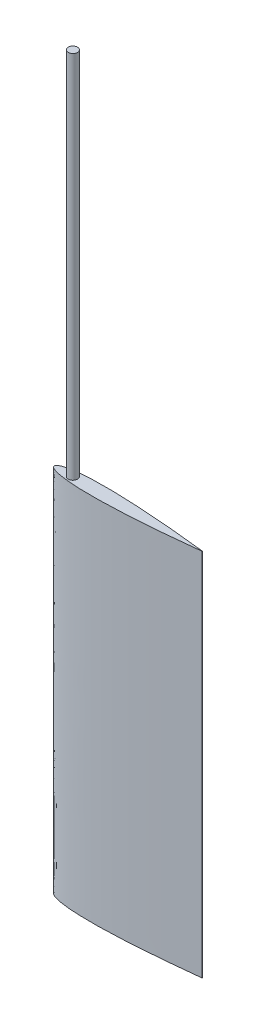
ISO-10303-21;
HEADER;
FILE_DESCRIPTION(('STEP AP214'),'2;1');
FILE_NAME('part.step','',(''),(''),'','','');
FILE_SCHEMA(('AUTOMOTIVE_DESIGN { 1 0 10303 214 1 1 1 1 }'));
ENDSEC;
DATA;
#1=APPLICATION_CONTEXT('core data for automotive mechanical design processes');
#2=APPLICATION_PROTOCOL_DEFINITION('international standard','automotive_design',2000,#1);
#3=PRODUCT_CONTEXT('',#1,'mechanical');
#4=PRODUCT('Part','Part','',(#3));
#5=PRODUCT_RELATED_PRODUCT_CATEGORY('part','',(#4));
#6=PRODUCT_DEFINITION_FORMATION('','',#4);
#7=PRODUCT_DEFINITION_CONTEXT('part definition',#1,'design');
#8=PRODUCT_DEFINITION('design','',#6,#7);
#9=PRODUCT_DEFINITION_SHAPE('','',#8);
#10=(LENGTH_UNIT() NAMED_UNIT(*) SI_UNIT(.MILLI.,.METRE.));
#11=(NAMED_UNIT(*) PLANE_ANGLE_UNIT() SI_UNIT($,.RADIAN.));
#12=(NAMED_UNIT(*) SI_UNIT($,.STERADIAN.) SOLID_ANGLE_UNIT());
#13=UNCERTAINTY_MEASURE_WITH_UNIT(LENGTH_MEASURE(1.E-05),#10,'distance_accuracy_value','');
#14=(GEOMETRIC_REPRESENTATION_CONTEXT(3) GLOBAL_UNCERTAINTY_ASSIGNED_CONTEXT((#13)) GLOBAL_UNIT_ASSIGNED_CONTEXT((#10,
#11,#12)) REPRESENTATION_CONTEXT('',''));
#15=CARTESIAN_POINT('',(0.,0.,0.));
#16=DIRECTION('',(0.,0.,1.));
#17=DIRECTION('',(1.,0.,0.));
#18=AXIS2_PLACEMENT_3D('',#15,#16,#17);
#19=CARTESIAN_POINT('',(25.1294779083333,127.,-2.25491962728619));
#20=DIRECTION('',(0.,1.,0.));
#21=DIRECTION('',(0.,0.,1.));
#22=AXIS2_PLACEMENT_3D('',#19,#20,#21);
#23=PLANE('',#22);
#24=CARTESIAN_POINT('',(50.8000000000014,127.,-0.050799999999835));
#25=CARTESIAN_POINT('',(50.3453249392949,127.,-0.104031082732051));
#26=CARTESIAN_POINT('',(49.4408695062304,127.,-0.208017065824838));
#27=CARTESIAN_POINT('',(47.6684859255048,127.,-0.407189120160728));
#28=CARTESIAN_POINT('',(45.8657666198066,127.,-0.596961966477976));
#29=CARTESIAN_POINT('',(43.2451781873299,127.,-0.865215438865277));
#30=CARTESIAN_POINT('',(40.8226482145379,127.,-1.09507600632388));
#31=CARTESIAN_POINT('',(38.2648648409094,127.,-1.32623524540877));
#32=CARTESIAN_POINT('',(35.7853940983227,127.,-1.53341725309598));
#33=CARTESIAN_POINT('',(33.7646748443269,127.,-1.69432375387716));
#34=CARTESIAN_POINT('',(31.2631009408352,127.,-1.88046310825376));
#35=CARTESIAN_POINT('',(28.2455597715967,127.,-2.08477338286326));
#36=CARTESIAN_POINT('',(24.7316590398411,127.,-2.28756004644569));
#37=CARTESIAN_POINT('',(20.7072518659175,127.,-2.46037413626015));
#38=CARTESIAN_POINT('',(16.6831382416768,127.,-2.55493603480179));
#39=CARTESIAN_POINT('',(12.6557743619899,127.,-2.54503735482071));
#40=CARTESIAN_POINT('',(8.93289897919176,127.,-2.39921346510189));
#41=CARTESIAN_POINT('',(5.8049567303045,127.,-2.11908493885436));
#42=CARTESIAN_POINT('',(3.46770272337152,127.,-1.74589921321094));
#43=CARTESIAN_POINT('',(2.01408528796059,127.,-1.38423286792327));
#44=CARTESIAN_POINT('',(1.18997454436081,127.,-1.08934413225149));
#45=CARTESIAN_POINT('',(0.729954446982388,127.,-0.866200710154466));
#46=CARTESIAN_POINT('',(0.46151757573825,127.,-0.696025526067717));
#47=CARTESIAN_POINT('',(0.297995582088841,127.,-0.563951169672376));
#48=CARTESIAN_POINT('',(0.192542699009296,127.,-0.45656703586107));
#49=CARTESIAN_POINT('',(0.120575217009814,127.,-0.364149982349219));
#50=CARTESIAN_POINT('',(0.0697758912506084,127.,-0.280176128255786));
#51=CARTESIAN_POINT('',(0.0258862396562212,127.,-0.181796341547094));
#52=CARTESIAN_POINT('',(0.00576139014379808,127.,-0.1002108146736));
#53=CARTESIAN_POINT('',(2.12060022615974E-05,127.,-0.0398623555642404));
#54=CARTESIAN_POINT('',(0.,127.,0.));
#55=B_SPLINE_CURVE_WITH_KNOTS('',4,(#24,#25,#26,#27,#28,#29,#30,#31,#32,#33,#34,#35,#36,#37,#38,
#39,#40,#41,#42,#43,#44,#45,#46,#47,#48,#49,#50,#51,#52,#53,#54),.UNSPECIFIED.,.F.,.F.,(5,1,1,1,
1,1,1,1,1,1,1,1,1,1,1,1,1,1,1,1,1,1,1,1,1,1,1,5),(0.,0.0355294283498369,0.0710588566996737,
0.106588284495107,0.14211771229054,0.213176567682003,0.24870599540497,0.284235423127937,
0.319764850901377,0.355294278674818,0.426353134270575,0.497411989735219,0.56847084479538,
0.639529699673237,0.710588553719249,0.781647403797102,0.831460084652623,0.861083812461136,
0.877536842336149,0.887249385614157,0.893152686901891,0.897108240663614,0.899930372386634,
0.902057433093247,0.903755751967313,0.905359988363979,0.906843515824288,0.909641105411482),.UNSPECIFIED.);
#56=CARTESIAN_POINT('',(50.8,127.,-0.0507999999999993));
#57=VERTEX_POINT('',#56);
#58=CARTESIAN_POINT('',(0.,127.,0.));
#59=VERTEX_POINT('',#58);
#60=EDGE_CURVE('E87',#57,#59,#55,.T.);
#61=ORIENTED_EDGE('',*,*,#60,.T.);
#62=CARTESIAN_POINT('',(50.8000000000014,127.,0.050799999999835));
#63=CARTESIAN_POINT('',(50.3453249392949,127.,0.104031082732051));
#64=CARTESIAN_POINT('',(49.4408695062304,127.,0.208017065824838));
#65=CARTESIAN_POINT('',(47.6684859255048,127.,0.407189120160728));
#66=CARTESIAN_POINT('',(45.8657666198066,127.,0.596961966477976));
#67=CARTESIAN_POINT('',(43.2451781873299,127.,0.865215438865277));
#68=CARTESIAN_POINT('',(40.8226482145379,127.,1.09507600632388));
#69=CARTESIAN_POINT('',(38.2648648409094,127.,1.32623524540877));
#70=CARTESIAN_POINT('',(35.7853940983227,127.,1.53341725309598));
#71=CARTESIAN_POINT('',(33.7646748443269,127.,1.69432375387716));
#72=CARTESIAN_POINT('',(31.2631009408352,127.,1.88046310825376));
#73=CARTESIAN_POINT('',(28.2455597715967,127.,2.08477338286326));
#74=CARTESIAN_POINT('',(24.7316590398411,127.,2.28756004644569));
#75=CARTESIAN_POINT('',(20.7072518659175,127.,2.46037413626015));
#76=CARTESIAN_POINT('',(16.6831382416768,127.,2.55493603480179));
#77=CARTESIAN_POINT('',(12.6557743619899,127.,2.54503735482071));
#78=CARTESIAN_POINT('',(8.93289897919176,127.,2.39921346510189));
#79=CARTESIAN_POINT('',(5.8049567303045,127.,2.11908493885436));
#80=CARTESIAN_POINT('',(3.46770272337152,127.,1.74589921321094));
#81=CARTESIAN_POINT('',(2.01408528796059,127.,1.38423286792327));
#82=CARTESIAN_POINT('',(1.18997454436081,127.,1.08934413225149));
#83=CARTESIAN_POINT('',(0.729954446982388,127.,0.866200710154466));
#84=CARTESIAN_POINT('',(0.46151757573825,127.,0.696025526067717));
#85=CARTESIAN_POINT('',(0.297995582088841,127.,0.563951169672376));
#86=CARTESIAN_POINT('',(0.192542699009296,127.,0.45656703586107));
#87=CARTESIAN_POINT('',(0.120575217009814,127.,0.364149982349219));
#88=CARTESIAN_POINT('',(0.0697758912506084,127.,0.280176128255786));
#89=CARTESIAN_POINT('',(0.0258862396562212,127.,0.181796341547094));
#90=CARTESIAN_POINT('',(0.00576139014379808,127.,0.1002108146736));
#91=CARTESIAN_POINT('',(2.12060022615974E-05,127.,0.0398623555642404));
#92=CARTESIAN_POINT('',(0.,127.,0.));
#93=B_SPLINE_CURVE_WITH_KNOTS('',4,(#62,#63,#64,#65,#66,#67,#68,#69,#70,#71,#72,#73,#74,#75,#76,
#77,#78,#79,#80,#81,#82,#83,#84,#85,#86,#87,#88,#89,#90,#91,#92),.UNSPECIFIED.,.F.,.F.,(5,1,1,1,
1,1,1,1,1,1,1,1,1,1,1,1,1,1,1,1,1,1,1,1,1,1,1,5),(0.,0.0355294283498369,0.0710588566996737,
0.106588284495107,0.14211771229054,0.213176567682003,0.24870599540497,0.284235423127937,
0.319764850901377,0.355294278674818,0.426353134270575,0.497411989735219,0.56847084479538,
0.639529699673237,0.710588553719249,0.781647403797102,0.831460084652623,0.861083812461136,
0.877536842336149,0.887249385614157,0.893152686901891,0.897108240663614,0.899930372386634,
0.902057433093247,0.903755751967313,0.905359988363979,0.906843515824288,0.909641105411482),.UNSPECIFIED.);
#94=CARTESIAN_POINT('',(50.8,127.,0.0507999999999993));
#95=VERTEX_POINT('',#94);
#96=EDGE_CURVE('E117',#95,#59,#93,.T.);
#97=ORIENTED_EDGE('',*,*,#96,.F.);
#98=DIRECTION('',(0.,0.,-1.));
#99=VECTOR('',#98,1.);
#100=CARTESIAN_POINT('',(50.8,127.,-0.0507999999999993));
#101=LINE('',#100,#99);
#102=EDGE_CURVE('E51',#95,#57,#101,.T.);
#103=ORIENTED_EDGE('',*,*,#102,.T.);
#104=EDGE_LOOP('',(#61,#97,#103));
#105=FACE_BOUND('',#104,.T.);
#106=CARTESIAN_POINT('',(6.35,127.,0.));
#107=DIRECTION('',(0.,1.,0.));
#108=DIRECTION('',(0.,0.,1.));
#109=AXIS2_PLACEMENT_3D('',#106,#107,#108);
#110=CIRCLE('',#109,1.5875);
#111=CARTESIAN_POINT('',(6.35,127.,1.5875));
#112=VERTEX_POINT('',#111);
#113=EDGE_CURVE('E131',#112,#112,#110,.T.);
#114=ORIENTED_EDGE('',*,*,#113,.F.);
#115=EDGE_LOOP('',(#114));
#116=FACE_BOUND('',#115,.T.);
#117=ADVANCED_FACE('F40',(#105,#116),#23,.T.);
#118=DIRECTION('',(0.,-1.,0.));
#119=VECTOR('',#118,1.);
#120=SURFACE_OF_LINEAR_EXTRUSION('',#55,#119);
#121=CARTESIAN_POINT('',(50.8000000000014,0.,-0.050799999999835));
#122=CARTESIAN_POINT('',(50.3453249392949,0.,-0.104031082732051));
#123=CARTESIAN_POINT('',(49.4408695062304,0.,-0.208017065824838));
#124=CARTESIAN_POINT('',(47.6684859255048,0.,-0.407189120160728));
#125=CARTESIAN_POINT('',(45.8657666198066,0.,-0.596961966477976));
#126=CARTESIAN_POINT('',(43.2451781873299,0.,-0.865215438865277));
#127=CARTESIAN_POINT('',(40.8226482145379,0.,-1.09507600632388));
#128=CARTESIAN_POINT('',(38.2648648409094,0.,-1.32623524540877));
#129=CARTESIAN_POINT('',(35.7853940983227,0.,-1.53341725309598));
#130=CARTESIAN_POINT('',(33.7646748443269,0.,-1.69432375387716));
#131=CARTESIAN_POINT('',(31.2631009408352,0.,-1.88046310825376));
#132=CARTESIAN_POINT('',(28.2455597715967,0.,-2.08477338286326));
#133=CARTESIAN_POINT('',(24.7316590398411,0.,-2.28756004644569));
#134=CARTESIAN_POINT('',(20.7072518659175,0.,-2.46037413626015));
#135=CARTESIAN_POINT('',(16.6831382416768,0.,-2.55493603480179));
#136=CARTESIAN_POINT('',(12.6557743619899,0.,-2.54503735482071));
#137=CARTESIAN_POINT('',(8.93289897919176,0.,-2.39921346510189));
#138=CARTESIAN_POINT('',(5.8049567303045,0.,-2.11908493885436));
#139=CARTESIAN_POINT('',(3.46770272337152,0.,-1.74589921321094));
#140=CARTESIAN_POINT('',(2.01408528796059,0.,-1.38423286792327));
#141=CARTESIAN_POINT('',(1.18997454436081,0.,-1.08934413225149));
#142=CARTESIAN_POINT('',(0.729954446982388,0.,-0.866200710154466));
#143=CARTESIAN_POINT('',(0.46151757573825,0.,-0.696025526067717));
#144=CARTESIAN_POINT('',(0.297995582088841,0.,-0.563951169672376));
#145=CARTESIAN_POINT('',(0.192542699009296,0.,-0.45656703586107));
#146=CARTESIAN_POINT('',(0.120575217009814,0.,-0.364149982349219));
#147=CARTESIAN_POINT('',(0.0697758912506084,0.,-0.280176128255786));
#148=CARTESIAN_POINT('',(0.0258862396562212,0.,-0.181796341547094));
#149=CARTESIAN_POINT('',(0.00576139014379808,0.,-0.1002108146736));
#150=CARTESIAN_POINT('',(2.12060022615974E-05,0.,-0.0398623555642404));
#151=CARTESIAN_POINT('',(0.,0.,0.));
#152=B_SPLINE_CURVE_WITH_KNOTS('',4,(#121,#122,#123,#124,#125,#126,#127,#128,#129,#130,#131,
#132,#133,#134,#135,#136,#137,#138,#139,#140,#141,#142,#143,#144,#145,#146,#147,#148,#149,#150,
#151),.UNSPECIFIED.,.F.,.F.,(5,1,1,1,1,1,1,1,1,1,1,1,1,1,1,1,1,1,1,1,1,1,1,1,1,1,1,5),(0.,
0.0355294283498369,0.0710588566996737,0.106588284495107,0.14211771229054,0.213176567682003,
0.24870599540497,0.284235423127937,0.319764850901377,0.355294278674818,0.426353134270575,
0.497411989735219,0.56847084479538,0.639529699673237,0.710588553719249,0.781647403797102,
0.831460084652623,0.861083812461136,0.877536842336149,0.887249385614157,0.893152686901891,
0.897108240663614,0.899930372386634,0.902057433093247,0.903755751967313,0.905359988363979,
0.906843515824288,0.909641105411482),.UNSPECIFIED.);
#153=CARTESIAN_POINT('',(50.8,0.,-0.0507999999999993));
#154=VERTEX_POINT('',#153);
#155=CARTESIAN_POINT('',(0.,0.,0.));
#156=VERTEX_POINT('',#155);
#157=EDGE_CURVE('E88',#154,#156,#152,.T.);
#158=ORIENTED_EDGE('',*,*,#157,.T.);
#159=DIRECTION('',(0.,-1.,0.));
#160=VECTOR('',#159,1.);
#161=CARTESIAN_POINT('',(0.,127.,0.));
#162=LINE('',#161,#160);
#163=EDGE_CURVE('E95',#59,#156,#162,.T.);
#164=ORIENTED_EDGE('',*,*,#163,.F.);
#165=ORIENTED_EDGE('',*,*,#60,.F.);
#166=DIRECTION('',(0.,-1.,0.));
#167=VECTOR('',#166,1.);
#168=CARTESIAN_POINT('',(50.8,127.,-0.0507999999999993));
#169=LINE('',#168,#167);
#170=EDGE_CURVE('E11',#57,#154,#169,.T.);
#171=ORIENTED_EDGE('',*,*,#170,.T.);
#172=EDGE_LOOP('',(#158,#164,#165,#171));
#173=FACE_BOUND('',#172,.T.);
#174=ADVANCED_FACE('F42',(#173),#120,.F.);
#175=CARTESIAN_POINT('',(50.8,127.,-0.0507999999999993));
#176=DIRECTION('',(-1.,0.,0.));
#177=DIRECTION('',(0.,0.,1.));
#178=AXIS2_PLACEMENT_3D('',#175,#176,#177);
#179=PLANE('',#178);
#180=DIRECTION('',(0.,0.,-1.));
#181=VECTOR('',#180,1.);
#182=CARTESIAN_POINT('',(50.8,0.,-0.0507999999999993));
#183=LINE('',#182,#181);
#184=CARTESIAN_POINT('',(50.8,0.,0.0507999999999993));
#185=VERTEX_POINT('',#184);
#186=EDGE_CURVE('E77',#185,#154,#183,.T.);
#187=ORIENTED_EDGE('',*,*,#186,.T.);
#188=ORIENTED_EDGE('',*,*,#170,.F.);
#189=ORIENTED_EDGE('',*,*,#102,.F.);
#190=DIRECTION('',(0.,-1.,0.));
#191=VECTOR('',#190,1.);
#192=CARTESIAN_POINT('',(50.8,127.,0.0507999999999993));
#193=LINE('',#192,#191);
#194=EDGE_CURVE('E81',#95,#185,#193,.T.);
#195=ORIENTED_EDGE('',*,*,#194,.T.);
#196=EDGE_LOOP('',(#187,#188,#189,#195));
#197=FACE_BOUND('',#196,.T.);
#198=ADVANCED_FACE('F78',(#197),#179,.F.);
#199=CARTESIAN_POINT('',(25.1294779083333,0.,-2.25491962728619));
#200=DIRECTION('',(0.,1.,0.));
#201=DIRECTION('',(0.,0.,1.));
#202=AXIS2_PLACEMENT_3D('',#199,#200,#201);
#203=PLANE('',#202);
#204=ORIENTED_EDGE('',*,*,#157,.F.);
#205=ORIENTED_EDGE('',*,*,#186,.F.);
#206=CARTESIAN_POINT('',(50.8000000000014,0.,0.050799999999835));
#207=CARTESIAN_POINT('',(50.3453249392949,0.,0.104031082732051));
#208=CARTESIAN_POINT('',(49.4408695062304,0.,0.208017065824838));
#209=CARTESIAN_POINT('',(47.6684859255048,0.,0.407189120160728));
#210=CARTESIAN_POINT('',(45.8657666198066,0.,0.596961966477976));
#211=CARTESIAN_POINT('',(43.2451781873299,0.,0.865215438865277));
#212=CARTESIAN_POINT('',(40.8226482145379,0.,1.09507600632388));
#213=CARTESIAN_POINT('',(38.2648648409094,0.,1.32623524540877));
#214=CARTESIAN_POINT('',(35.7853940983227,0.,1.53341725309598));
#215=CARTESIAN_POINT('',(33.7646748443269,0.,1.69432375387716));
#216=CARTESIAN_POINT('',(31.2631009408352,0.,1.88046310825376));
#217=CARTESIAN_POINT('',(28.2455597715967,0.,2.08477338286326));
#218=CARTESIAN_POINT('',(24.7316590398411,0.,2.28756004644569));
#219=CARTESIAN_POINT('',(20.7072518659175,0.,2.46037413626015));
#220=CARTESIAN_POINT('',(16.6831382416768,0.,2.55493603480179));
#221=CARTESIAN_POINT('',(12.6557743619899,0.,2.54503735482071));
#222=CARTESIAN_POINT('',(8.93289897919176,0.,2.39921346510189));
#223=CARTESIAN_POINT('',(5.8049567303045,0.,2.11908493885436));
#224=CARTESIAN_POINT('',(3.46770272337152,0.,1.74589921321094));
#225=CARTESIAN_POINT('',(2.01408528796059,0.,1.38423286792327));
#226=CARTESIAN_POINT('',(1.18997454436081,0.,1.08934413225149));
#227=CARTESIAN_POINT('',(0.729954446982388,0.,0.866200710154466));
#228=CARTESIAN_POINT('',(0.46151757573825,0.,0.696025526067717));
#229=CARTESIAN_POINT('',(0.297995582088841,0.,0.563951169672376));
#230=CARTESIAN_POINT('',(0.192542699009296,0.,0.45656703586107));
#231=CARTESIAN_POINT('',(0.120575217009814,0.,0.364149982349219));
#232=CARTESIAN_POINT('',(0.0697758912506084,0.,0.280176128255786));
#233=CARTESIAN_POINT('',(0.0258862396562212,0.,0.181796341547094));
#234=CARTESIAN_POINT('',(0.00576139014379808,0.,0.1002108146736));
#235=CARTESIAN_POINT('',(2.12060022615974E-05,0.,0.0398623555642404));
#236=CARTESIAN_POINT('',(0.,0.,0.));
#237=B_SPLINE_CURVE_WITH_KNOTS('',4,(#206,#207,#208,#209,#210,#211,#212,#213,#214,#215,#216,
#217,#218,#219,#220,#221,#222,#223,#224,#225,#226,#227,#228,#229,#230,#231,#232,#233,#234,#235,
#236),.UNSPECIFIED.,.F.,.F.,(5,1,1,1,1,1,1,1,1,1,1,1,1,1,1,1,1,1,1,1,1,1,1,1,1,1,1,5),(0.,
0.0355294283498369,0.0710588566996737,0.106588284495107,0.14211771229054,0.213176567682003,
0.24870599540497,0.284235423127937,0.319764850901377,0.355294278674818,0.426353134270575,
0.497411989735219,0.56847084479538,0.639529699673237,0.710588553719249,0.781647403797102,
0.831460084652623,0.861083812461136,0.877536842336149,0.887249385614157,0.893152686901891,
0.897108240663614,0.899930372386634,0.902057433093247,0.903755751967313,0.905359988363979,
0.906843515824288,0.909641105411482),.UNSPECIFIED.);
#238=EDGE_CURVE('E93',#185,#156,#237,.T.);
#239=ORIENTED_EDGE('',*,*,#238,.T.);
#240=EDGE_LOOP('',(#204,#205,#239));
#241=FACE_BOUND('',#240,.T.);
#242=ADVANCED_FACE('F92',(#241),#203,.F.);
#243=DIRECTION('',(0.,-1.,0.));
#244=VECTOR('',#243,1.);
#245=SURFACE_OF_LINEAR_EXTRUSION('',#93,#244);
#246=ORIENTED_EDGE('',*,*,#238,.F.);
#247=ORIENTED_EDGE('',*,*,#194,.F.);
#248=ORIENTED_EDGE('',*,*,#96,.T.);
#249=ORIENTED_EDGE('',*,*,#163,.T.);
#250=EDGE_LOOP('',(#246,#247,#248,#249));
#251=FACE_BOUND('',#250,.T.);
#252=ADVANCED_FACE('F137',(#251),#245,.T.);
#253=CARTESIAN_POINT('',(6.35,254.,0.));
#254=DIRECTION('',(0.,-1.,0.));
#255=DIRECTION('',(0.,0.,-1.));
#256=AXIS2_PLACEMENT_3D('',#253,#254,#255);
#257=CYLINDRICAL_SURFACE('',#256,1.5875);
#258=CARTESIAN_POINT('',(6.35,254.,0.));
#259=DIRECTION('',(0.,1.,0.));
#260=DIRECTION('',(0.,0.,1.));
#261=AXIS2_PLACEMENT_3D('',#258,#259,#260);
#262=CIRCLE('',#261,1.5875);
#263=CARTESIAN_POINT('',(6.35,254.,1.5875));
#264=VERTEX_POINT('',#263);
#265=EDGE_CURVE('E121',#264,#264,#262,.T.);
#266=ORIENTED_EDGE('',*,*,#265,.F.);
#267=EDGE_LOOP('',(#266));
#268=FACE_BOUND('',#267,.T.);
#269=ORIENTED_EDGE('',*,*,#113,.T.);
#270=EDGE_LOOP('',(#269));
#271=FACE_BOUND('',#270,.T.);
#272=ADVANCED_FACE('F141',(#268,#271),#257,.T.);
#273=CARTESIAN_POINT('',(6.35,254.,0.));
#274=DIRECTION('',(0.,1.,0.));
#275=DIRECTION('',(0.,0.,1.));
#276=AXIS2_PLACEMENT_3D('',#273,#274,#275);
#277=PLANE('',#276);
#278=ORIENTED_EDGE('',*,*,#265,.T.);
#279=EDGE_LOOP('',(#278));
#280=FACE_BOUND('',#279,.T.);
#281=ADVANCED_FACE('F164',(#280),#277,.T.);
#282=CLOSED_SHELL('',(#117,#174,#198,#242,#252,#272,#281));
#283=MANIFOLD_SOLID_BREP('B2',#282);
#284=ADVANCED_BREP_SHAPE_REPRESENTATION('',(#18,#283),#14);
#285=SHAPE_DEFINITION_REPRESENTATION(#9,#284);
ENDSEC;
END-ISO-10303-21;
